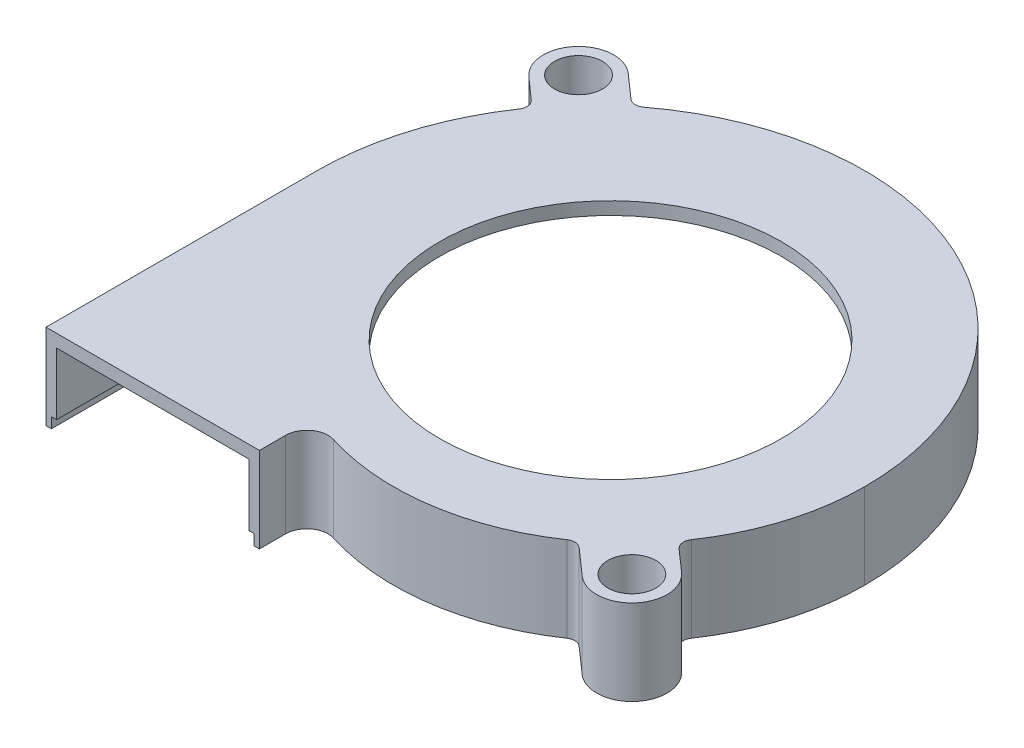
ISO-10303-21;
HEADER;
FILE_DESCRIPTION(('STEP AP214'),'2;1');
FILE_NAME('part.step','',(''),(''),'','','');
FILE_SCHEMA(('AUTOMOTIVE_DESIGN { 1 0 10303 214 1 1 1 1 }'));
ENDSEC;
DATA;
#1=APPLICATION_CONTEXT('core data for automotive mechanical design processes');
#2=APPLICATION_PROTOCOL_DEFINITION('international standard','automotive_design',2000,#1);
#3=PRODUCT_CONTEXT('',#1,'mechanical');
#4=PRODUCT('Part','Part','',(#3));
#5=PRODUCT_RELATED_PRODUCT_CATEGORY('part','',(#4));
#6=PRODUCT_DEFINITION_FORMATION('','',#4);
#7=PRODUCT_DEFINITION_CONTEXT('part definition',#1,'design');
#8=PRODUCT_DEFINITION('design','',#6,#7);
#9=PRODUCT_DEFINITION_SHAPE('','',#8);
#10=(LENGTH_UNIT() NAMED_UNIT(*) SI_UNIT(.MILLI.,.METRE.));
#11=(NAMED_UNIT(*) PLANE_ANGLE_UNIT() SI_UNIT($,.RADIAN.));
#12=(NAMED_UNIT(*) SI_UNIT($,.STERADIAN.) SOLID_ANGLE_UNIT());
#13=UNCERTAINTY_MEASURE_WITH_UNIT(LENGTH_MEASURE(1.E-05),#10,'distance_accuracy_value','');
#14=(GEOMETRIC_REPRESENTATION_CONTEXT(3) GLOBAL_UNCERTAINTY_ASSIGNED_CONTEXT((#13)) GLOBAL_UNIT_ASSIGNED_CONTEXT((#10,
#11,#12)) REPRESENTATION_CONTEXT('',''));
#15=CARTESIAN_POINT('',(0.,0.,0.));
#16=DIRECTION('',(0.,0.,1.));
#17=DIRECTION('',(1.,0.,0.));
#18=AXIS2_PLACEMENT_3D('',#15,#16,#17);
#19=CARTESIAN_POINT('',(-8.5,70.26503959981,25.4));
#20=DIRECTION('',(1.,0.,0.));
#21=DIRECTION('',(0.,0.,-1.));
#22=AXIS2_PLACEMENT_3D('',#19,#20,#21);
#23=PLANE('',#22);
#24=DIRECTION('',(0.,0.,-1.));
#25=VECTOR('',#24,1.);
#26=CARTESIAN_POINT('',(-8.5,-7.,22.9558491109208));
#27=LINE('',#26,#25);
#28=CARTESIAN_POINT('',(-8.5,-7.,25.4));
#29=VERTEX_POINT('',#28);
#30=CARTESIAN_POINT('',(-8.5,-7.,22.9558491109208));
#31=VERTEX_POINT('',#30);
#32=EDGE_CURVE('E630',#29,#31,#27,.T.);
#33=ORIENTED_EDGE('',*,*,#32,.F.);
#34=DIRECTION('',(0.,-1.,0.));
#35=VECTOR('',#34,1.);
#36=CARTESIAN_POINT('',(-8.5,70.26503959981,25.4));
#37=LINE('',#36,#35);
#38=CARTESIAN_POINT('',(-8.5,-1.20000000000001,25.4));
#39=VERTEX_POINT('',#38);
#40=EDGE_CURVE('E578',#39,#29,#37,.T.);
#41=ORIENTED_EDGE('',*,*,#40,.F.);
#42=DIRECTION('',(0.,0.,-1.));
#43=VECTOR('',#42,1.);
#44=CARTESIAN_POINT('',(-8.5,-1.20000000000001,25.4));
#45=LINE('',#44,#43);
#46=CARTESIAN_POINT('',(-8.49999999999999,-1.20000000000001,22.9558491109208));
#47=VERTEX_POINT('',#46);
#48=EDGE_CURVE('E635',#39,#47,#45,.T.);
#49=ORIENTED_EDGE('',*,*,#48,.T.);
#50=DIRECTION('',(0.,-1.,0.));
#51=VECTOR('',#50,1.);
#52=CARTESIAN_POINT('',(-8.5,70.26503959981,22.9558491109208));
#53=LINE('',#52,#51);
#54=EDGE_CURVE('E647',#47,#31,#53,.T.);
#55=ORIENTED_EDGE('',*,*,#54,.T.);
#56=EDGE_LOOP('',(#33,#41,#49,#55));
#57=FACE_BOUND('',#56,.T.);
#58=ADVANCED_FACE('F42',(#57),#23,.F.);
#59=CARTESIAN_POINT('',(-5.5,70.26503959981,22.9558491109208));
#60=DIRECTION('',(0.,-1.,0.));
#61=DIRECTION('',(0.,0.,-1.));
#62=AXIS2_PLACEMENT_3D('',#59,#60,#61);
#63=CYLINDRICAL_SURFACE('',#62,3.);
#64=CARTESIAN_POINT('',(-5.5,-7.,22.9558491109208));
#65=DIRECTION('',(0.,-1.,0.));
#66=DIRECTION('',(0.,0.,-1.));
#67=AXIS2_PLACEMENT_3D('',#64,#65,#66);
#68=CIRCLE('',#67,3.);
#69=CARTESIAN_POINT('',(-4.5985649942554,-7.,20.0944831905794));
#70=VERTEX_POINT('',#69);
#71=EDGE_CURVE('E564',#31,#70,#68,.T.);
#72=ORIENTED_EDGE('',*,*,#71,.F.);
#73=ORIENTED_EDGE('',*,*,#54,.F.);
#74=CARTESIAN_POINT('',(-5.5,-1.20000000000001,22.9558491109208));
#75=DIRECTION('',(0.,-1.,0.));
#76=DIRECTION('',(0.,0.,-1.));
#77=AXIS2_PLACEMENT_3D('',#74,#75,#76);
#78=CIRCLE('',#77,3.);
#79=CARTESIAN_POINT('',(-4.59856499423902,-1.20000000000001,20.0944831905274));
#80=VERTEX_POINT('',#79);
#81=EDGE_CURVE('E585',#47,#80,#78,.T.);
#82=ORIENTED_EDGE('',*,*,#81,.T.);
#83=DIRECTION('',(0.,-1.,0.));
#84=VECTOR('',#83,1.);
#85=CARTESIAN_POINT('',(-4.59856499423902,70.26503959981,20.0944831905274));
#86=LINE('',#85,#84);
#87=EDGE_CURVE('E651',#80,#70,#86,.T.);
#88=ORIENTED_EDGE('',*,*,#87,.T.);
#89=EDGE_LOOP('',(#72,#73,#82,#88));
#90=FACE_BOUND('',#89,.T.);
#91=ADVANCED_FACE('F391',(#90),#63,.T.);
#92=CARTESIAN_POINT('',(1.73193277310925,70.26503959981,0.));
#93=DIRECTION('',(0.,-1.,0.));
#94=DIRECTION('',(0.,0.,-1.));
#95=AXIS2_PLACEMENT_3D('',#92,#93,#94);
#96=CYLINDRICAL_SURFACE('',#95,21.0680672268908);
#97=CARTESIAN_POINT('',(1.73193277310925,-7.,0.));
#98=DIRECTION('',(0.,1.,0.));
#99=DIRECTION('',(0.,0.,-1.));
#100=AXIS2_PLACEMENT_3D('',#97,#98,#99);
#101=CIRCLE('',#100,21.0680672269453);
#102=CARTESIAN_POINT('',(22.800000024916,-7.,-0.000327043078988983));
#103=VERTEX_POINT('',#102);
#104=EDGE_CURVE('E566',#70,#103,#101,.T.);
#105=ORIENTED_EDGE('',*,*,#104,.F.);
#106=ORIENTED_EDGE('',*,*,#87,.F.);
#107=CARTESIAN_POINT('',(1.73193277310925,-1.20000000000001,0.));
#108=DIRECTION('',(0.,-1.,0.));
#109=DIRECTION('',(0.,0.,-1.));
#110=AXIS2_PLACEMENT_3D('',#107,#108,#109);
#111=CIRCLE('',#110,21.0680672268908);
#112=CARTESIAN_POINT('',(22.7999999974641,-1.20000000000001,-0.000326883642031274));
#113=VERTEX_POINT('',#112);
#114=EDGE_CURVE('E577',#80,#113,#111,.F.);
#115=ORIENTED_EDGE('',*,*,#114,.T.);
#116=DIRECTION('',(0.,-1.,0.));
#117=VECTOR('',#116,1.);
#118=CARTESIAN_POINT('',(22.7999999974641,70.26503959981,-0.000326883642031271));
#119=LINE('',#118,#117);
#120=EDGE_CURVE('E655',#113,#103,#119,.T.);
#121=ORIENTED_EDGE('',*,*,#120,.T.);
#122=EDGE_LOOP('',(#105,#106,#115,#121));
#123=FACE_BOUND('',#122,.T.);
#124=ADVANCED_FACE('F397',(#123),#96,.F.);
#125=CARTESIAN_POINT('',(-1.85,70.26503959981,-0.016796874999999));
#126=DIRECTION('',(0.,-1.,0.));
#127=DIRECTION('',(0.,0.,-1.));
#128=AXIS2_PLACEMENT_3D('',#125,#126,#127);
#129=CYLINDRICAL_SURFACE('',#128,24.6500054997072);
#130=CARTESIAN_POINT('',(-1.85,-7.,-0.016796874999999));
#131=DIRECTION('',(0.,1.,0.));
#132=DIRECTION('',(0.,0.,-1.));
#133=AXIS2_PLACEMENT_3D('',#130,#131,#132);
#134=CIRCLE('',#133,24.6500055270525);
#135=CARTESIAN_POINT('',(-26.5000000525161,-7.00000000000001,-0.000327424430267257));
#136=VERTEX_POINT('',#135);
#137=EDGE_CURVE('E63',#103,#136,#134,.T.);
#138=ORIENTED_EDGE('',*,*,#137,.F.);
#139=ORIENTED_EDGE('',*,*,#120,.F.);
#140=CARTESIAN_POINT('',(-1.85,-1.20000000000001,-0.016796874999999));
#141=DIRECTION('',(0.,-1.,0.));
#142=DIRECTION('',(0.,0.,-1.));
#143=AXIS2_PLACEMENT_3D('',#140,#141,#142);
#144=CIRCLE('',#143,24.6500054997072);
#145=CARTESIAN_POINT('',(-26.5000000525161,-1.20000000000001,-0.000327424430267257));
#146=VERTEX_POINT('',#145);
#147=EDGE_CURVE('E575',#113,#146,#144,.F.);
#148=ORIENTED_EDGE('',*,*,#147,.T.);
#149=DIRECTION('',(0.,-1.,0.));
#150=VECTOR('',#149,1.);
#151=CARTESIAN_POINT('',(-26.5000000525161,70.26503959981,-0.000327424430267257));
#152=LINE('',#151,#150);
#153=EDGE_CURVE('E659',#146,#136,#152,.T.);
#154=ORIENTED_EDGE('',*,*,#153,.T.);
#155=EDGE_LOOP('',(#138,#139,#148,#154));
#156=FACE_BOUND('',#155,.T.);
#157=ADVANCED_FACE('F407',(#156),#129,.F.);
#158=CARTESIAN_POINT('',(-26.5000001072067,70.26503959981,-0.000327424393735107));
#159=DIRECTION('',(-1.,0.,4.22068338812948E-09));
#160=DIRECTION('',(4.22068338812948E-09,0.,1.));
#161=AXIS2_PLACEMENT_3D('',#158,#159,#160);
#162=PLANE('',#161);
#163=DIRECTION('',(-4.28055939719574E-11,0.,1.));
#164=VECTOR('',#163,1.);
#165=CARTESIAN_POINT('',(-26.5000000536034,-7.,25.4));
#166=LINE('',#165,#164);
#167=CARTESIAN_POINT('',(-26.5000000536034,-7.,25.4));
#168=VERTEX_POINT('',#167);
#169=EDGE_CURVE('E581',#136,#168,#166,.T.);
#170=ORIENTED_EDGE('',*,*,#169,.F.);
#171=ORIENTED_EDGE('',*,*,#153,.F.);
#172=DIRECTION('',(4.22068338812948E-09,0.,1.));
#173=VECTOR('',#172,1.);
#174=CARTESIAN_POINT('',(-26.5000001072067,-1.20000000000001,-0.000327424393735107));
#175=LINE('',#174,#173);
#176=CARTESIAN_POINT('',(-26.5,-1.20000000000001,25.4));
#177=VERTEX_POINT('',#176);
#178=EDGE_CURVE('E643',#146,#177,#175,.T.);
#179=ORIENTED_EDGE('',*,*,#178,.T.);
#180=DIRECTION('',(0.,-1.,0.));
#181=VECTOR('',#180,1.);
#182=CARTESIAN_POINT('',(-26.5,70.26503959981,25.4));
#183=LINE('',#182,#181);
#184=EDGE_CURVE('E617',#177,#168,#183,.T.);
#185=ORIENTED_EDGE('',*,*,#184,.T.);
#186=EDGE_LOOP('',(#170,#171,#179,#185));
#187=FACE_BOUND('',#186,.T.);
#188=ADVANCED_FACE('F411',(#187),#162,.F.);
#189=CARTESIAN_POINT('',(0.,-8.,0.));
#190=DIRECTION('',(0.,1.,0.));
#191=DIRECTION('',(0.,0.,1.));
#192=AXIS2_PLACEMENT_3D('',#189,#190,#191);
#193=CYLINDRICAL_SURFACE('',#192,16.);
#194=CARTESIAN_POINT('',(0.,0.,0.));
#195=DIRECTION('',(0.,1.,0.));
#196=DIRECTION('',(0.,0.,1.));
#197=AXIS2_PLACEMENT_3D('',#194,#195,#196);
#198=CIRCLE('',#197,16.);
#199=CARTESIAN_POINT('',(0.,0.,16.));
#200=VERTEX_POINT('',#199);
#201=EDGE_CURVE('E435',#200,#200,#198,.T.);
#202=ORIENTED_EDGE('',*,*,#201,.T.);
#203=EDGE_LOOP('',(#202));
#204=FACE_BOUND('',#203,.T.);
#205=CARTESIAN_POINT('',(0.,-1.2,0.));
#206=DIRECTION('',(0.,-1.,0.));
#207=DIRECTION('',(0.,0.,-1.));
#208=AXIS2_PLACEMENT_3D('',#205,#206,#207);
#209=CIRCLE('',#208,16.);
#210=CARTESIAN_POINT('',(0.,-1.2,-16.));
#211=VERTEX_POINT('',#210);
#212=EDGE_CURVE('E46',#211,#211,#209,.F.);
#213=ORIENTED_EDGE('',*,*,#212,.F.);
#214=EDGE_LOOP('',(#213));
#215=FACE_BOUND('',#214,.T.);
#216=ADVANCED_FACE('F388',(#204,#215),#193,.F.);
#217=CARTESIAN_POINT('',(-23.,-8.,-20.));
#218=DIRECTION('',(0.,1.,0.));
#219=DIRECTION('',(0.,0.,1.));
#220=AXIS2_PLACEMENT_3D('',#217,#218,#219);
#221=CYLINDRICAL_SURFACE('',#220,3.3);
#222=CARTESIAN_POINT('',(-23.,0.,-20.));
#223=DIRECTION('',(0.,1.,0.));
#224=DIRECTION('',(0.,0.,-1.));
#225=AXIS2_PLACEMENT_3D('',#222,#223,#224);
#226=CIRCLE('',#225,3.3);
#227=CARTESIAN_POINT('',(-20.8147472716434,0.,-22.4727859820878));
#228=VERTEX_POINT('',#227);
#229=CARTESIAN_POINT('',(-25.1852527283566,0.,-17.5272140179122));
#230=VERTEX_POINT('',#229);
#231=EDGE_CURVE('E262',#228,#230,#226,.T.);
#232=ORIENTED_EDGE('',*,*,#231,.F.);
#233=DIRECTION('',(0.,1.,0.));
#234=VECTOR('',#233,1.);
#235=CARTESIAN_POINT('',(-20.8147472716434,-8.,-22.4727859820878));
#236=LINE('',#235,#234);
#237=CARTESIAN_POINT('',(-20.8147472716434,-8.,-22.4727859820878));
#238=VERTEX_POINT('',#237);
#239=EDGE_CURVE('E12',#238,#228,#236,.T.);
#240=ORIENTED_EDGE('',*,*,#239,.F.);
#241=CARTESIAN_POINT('',(-23.,-8.,-20.));
#242=DIRECTION('',(0.,1.,0.));
#243=DIRECTION('',(0.,0.,-1.));
#244=AXIS2_PLACEMENT_3D('',#241,#242,#243);
#245=CIRCLE('',#244,3.3);
#246=CARTESIAN_POINT('',(-25.1852527283566,-8.,-17.5272140179122));
#247=VERTEX_POINT('',#246);
#248=EDGE_CURVE('E331',#238,#247,#245,.T.);
#249=ORIENTED_EDGE('',*,*,#248,.T.);
#250=DIRECTION('',(0.,1.,0.));
#251=VECTOR('',#250,1.);
#252=CARTESIAN_POINT('',(-25.1852527283566,-8.,-17.5272140179122));
#253=LINE('',#252,#251);
#254=EDGE_CURVE('E160',#247,#230,#253,.T.);
#255=ORIENTED_EDGE('',*,*,#254,.T.);
#256=EDGE_LOOP('',(#232,#240,#249,#255));
#257=FACE_BOUND('',#256,.T.);
#258=ADVANCED_FACE('F44',(#257),#221,.T.);
#259=CARTESIAN_POINT('',(-20.8147472716434,-8.,-22.4727859820878));
#260=DIRECTION('',(0.66219779647171,0.,-0.749329085481147));
#261=DIRECTION('',(-0.749329085481147,0.,-0.66219779647171));
#262=AXIS2_PLACEMENT_3D('',#259,#260,#261);
#263=PLANE('',#262);
#264=DIRECTION('',(-0.749329085481147,0.,-0.66219779647171));
#265=VECTOR('',#264,1.);
#266=CARTESIAN_POINT('',(-20.8147472716434,0.,-22.4727859820878));
#267=LINE('',#266,#265);
#268=CARTESIAN_POINT('',(-18.5989053771657,0.,-20.5146001218517));
#269=VERTEX_POINT('',#268);
#270=EDGE_CURVE('E328',#269,#228,#267,.T.);
#271=ORIENTED_EDGE('',*,*,#270,.F.);
#272=DIRECTION('',(0.,1.,0.));
#273=VECTOR('',#272,1.);
#274=CARTESIAN_POINT('',(-18.5989053771657,-8.,-20.5146001218517));
#275=LINE('',#274,#273);
#276=CARTESIAN_POINT('',(-18.5989053771657,-8.,-20.5146001218517));
#277=VERTEX_POINT('',#276);
#278=EDGE_CURVE('E52',#277,#269,#275,.T.);
#279=ORIENTED_EDGE('',*,*,#278,.F.);
#280=DIRECTION('',(-0.749329085481147,0.,-0.66219779647171));
#281=VECTOR('',#280,1.);
#282=CARTESIAN_POINT('',(-20.8147472716434,-8.,-22.4727859820878));
#283=LINE('',#282,#281);
#284=EDGE_CURVE('E246',#277,#238,#283,.T.);
#285=ORIENTED_EDGE('',*,*,#284,.T.);
#286=ORIENTED_EDGE('',*,*,#239,.T.);
#287=EDGE_LOOP('',(#271,#279,#285,#286));
#288=FACE_BOUND('',#287,.T.);
#289=ADVANCED_FACE('F380',(#288),#263,.T.);
#290=CARTESIAN_POINT('',(-17.936707580694,-8.,-21.2639292073329));
#291=DIRECTION('',(0.,1.,0.));
#292=DIRECTION('',(0.,0.,1.));
#293=AXIS2_PLACEMENT_3D('',#290,#291,#292);
#294=CYLINDRICAL_SURFACE('',#293,1.);
#295=CARTESIAN_POINT('',(-17.936707580694,0.,-21.2639292073329));
#296=DIRECTION('',(0.,-1.,0.));
#297=DIRECTION('',(0.,0.,1.));
#298=AXIS2_PLACEMENT_3D('',#295,#296,#297);
#299=CIRCLE('',#298,1.);
#300=CARTESIAN_POINT('',(-17.3330789029862,0.,-20.4666636183045));
#301=VERTEX_POINT('',#300);
#302=EDGE_CURVE('E230',#301,#269,#299,.T.);
#303=ORIENTED_EDGE('',*,*,#302,.F.);
#304=DIRECTION('',(0.,1.,0.));
#305=VECTOR('',#304,1.);
#306=CARTESIAN_POINT('',(-17.3330789029862,-8.,-20.4666636183045));
#307=LINE('',#306,#305);
#308=CARTESIAN_POINT('',(-17.3330789029862,-8.,-20.4666636183045));
#309=VERTEX_POINT('',#308);
#310=EDGE_CURVE('E224',#309,#301,#307,.T.);
#311=ORIENTED_EDGE('',*,*,#310,.F.);
#312=CARTESIAN_POINT('',(-17.936707580694,-8.,-21.2639292073329));
#313=DIRECTION('',(0.,-1.,0.));
#314=DIRECTION('',(0.,0.,1.));
#315=AXIS2_PLACEMENT_3D('',#312,#313,#314);
#316=CIRCLE('',#315,1.);
#317=EDGE_CURVE('E227',#309,#277,#316,.T.);
#318=ORIENTED_EDGE('',*,*,#317,.T.);
#319=ORIENTED_EDGE('',*,*,#278,.T.);
#320=EDGE_LOOP('',(#303,#311,#318,#319));
#321=FACE_BOUND('',#320,.T.);
#322=ADVANCED_FACE('F226',(#321),#294,.F.);
#323=CARTESIAN_POINT('',(-1.85,-8.,-0.016796874999999));
#324=DIRECTION('',(0.,1.,0.));
#325=DIRECTION('',(0.,0.,1.));
#326=AXIS2_PLACEMENT_3D('',#323,#324,#325);
#327=CYLINDRICAL_SURFACE('',#326,25.6500054997072);
#328=CARTESIAN_POINT('',(-1.85,0.,-0.016796874999999));
#329=DIRECTION('',(0.,1.,0.));
#330=DIRECTION('',(0.,0.,1.));
#331=AXIS2_PLACEMENT_3D('',#328,#329,#330);
#332=CIRCLE('',#331,25.6500054997072);
#333=CARTESIAN_POINT('',(23.8,0.,0.));
#334=VERTEX_POINT('',#333);
#335=EDGE_CURVE('E323',#334,#301,#332,.T.);
#336=ORIENTED_EDGE('',*,*,#335,.F.);
#337=DIRECTION('',(0.,1.,0.));
#338=VECTOR('',#337,1.);
#339=CARTESIAN_POINT('',(23.8,-8.,0.));
#340=LINE('',#339,#338);
#341=CARTESIAN_POINT('',(23.8,-8.,0.));
#342=VERTEX_POINT('',#341);
#343=EDGE_CURVE('E236',#342,#334,#340,.T.);
#344=ORIENTED_EDGE('',*,*,#343,.F.);
#345=CARTESIAN_POINT('',(-1.85,-8.,-0.016796874999999));
#346=DIRECTION('',(0.,1.,0.));
#347=DIRECTION('',(0.,0.,1.));
#348=AXIS2_PLACEMENT_3D('',#345,#346,#347);
#349=CIRCLE('',#348,25.6500054997072);
#350=EDGE_CURVE('E244',#342,#309,#349,.T.);
#351=ORIENTED_EDGE('',*,*,#350,.T.);
#352=ORIENTED_EDGE('',*,*,#310,.T.);
#353=EDGE_LOOP('',(#336,#344,#351,#352));
#354=FACE_BOUND('',#353,.T.);
#355=ADVANCED_FACE('F249',(#354),#327,.T.);
#356=CARTESIAN_POINT('',(1.73193277310925,-8.,0.));
#357=DIRECTION('',(0.,1.,0.));
#358=DIRECTION('',(0.,0.,1.));
#359=AXIS2_PLACEMENT_3D('',#356,#357,#358);
#360=CYLINDRICAL_SURFACE('',#359,22.0680672268908);
#361=CARTESIAN_POINT('',(1.73193277310925,0.,0.));
#362=DIRECTION('',(0.,1.,0.));
#363=DIRECTION('',(0.,0.,-1.));
#364=AXIS2_PLACEMENT_3D('',#361,#362,#363);
#365=CIRCLE('',#364,22.0680672268908);
#366=CARTESIAN_POINT('',(19.9790752063348,0.,12.4113409489929));
#367=VERTEX_POINT('',#366);
#368=EDGE_CURVE('E319',#367,#334,#365,.T.);
#369=ORIENTED_EDGE('',*,*,#368,.F.);
#370=DIRECTION('',(0.,1.,0.));
#371=VECTOR('',#370,1.);
#372=CARTESIAN_POINT('',(19.9790752063348,-8.,12.4113409489929));
#373=LINE('',#372,#371);
#374=CARTESIAN_POINT('',(19.9790752063348,-8.,12.4113409489929));
#375=VERTEX_POINT('',#374);
#376=EDGE_CURVE('E337',#375,#367,#373,.T.);
#377=ORIENTED_EDGE('',*,*,#376,.F.);
#378=CARTESIAN_POINT('',(1.73193277310925,-8.,0.));
#379=DIRECTION('',(0.,1.,0.));
#380=DIRECTION('',(0.,0.,-1.));
#381=AXIS2_PLACEMENT_3D('',#378,#379,#380);
#382=CIRCLE('',#381,22.0680672268908);
#383=EDGE_CURVE('E251',#375,#342,#382,.T.);
#384=ORIENTED_EDGE('',*,*,#383,.T.);
#385=ORIENTED_EDGE('',*,*,#343,.T.);
#386=EDGE_LOOP('',(#369,#377,#384,#385));
#387=FACE_BOUND('',#386,.T.);
#388=ADVANCED_FACE('F978',(#387),#360,.T.);
#389=CARTESIAN_POINT('',(20.8059325040591,-8.,12.9737527280304));
#390=DIRECTION('',(0.,1.,0.));
#391=DIRECTION('',(0.,0.,1.));
#392=AXIS2_PLACEMENT_3D('',#389,#390,#391);
#393=CYLINDRICAL_SURFACE('',#392,1.);
#394=CARTESIAN_POINT('',(20.8059325040591,0.,12.9737527280304));
#395=DIRECTION('',(0.,-1.,0.));
#396=DIRECTION('',(0.,0.,-1.));
#397=AXIS2_PLACEMENT_3D('',#394,#395,#396);
#398=CIRCLE('',#397,1.);
#399=CARTESIAN_POINT('',(20.1437347075874,0.,13.7230818135115));
#400=VERTEX_POINT('',#399);
#401=EDGE_CURVE('E315',#400,#367,#398,.T.);
#402=ORIENTED_EDGE('',*,*,#401,.F.);
#403=DIRECTION('',(0.,1.,0.));
#404=VECTOR('',#403,1.);
#405=CARTESIAN_POINT('',(20.1437347075874,-8.,13.7230818135115));
#406=LINE('',#405,#404);
#407=CARTESIAN_POINT('',(20.1437347075874,-8.,13.7230818135115));
#408=VERTEX_POINT('',#407);
#409=EDGE_CURVE('E340',#408,#400,#406,.T.);
#410=ORIENTED_EDGE('',*,*,#409,.F.);
#411=CARTESIAN_POINT('',(20.8059325040591,-8.,12.9737527280304));
#412=DIRECTION('',(0.,-1.,0.));
#413=DIRECTION('',(0.,0.,-1.));
#414=AXIS2_PLACEMENT_3D('',#411,#412,#413);
#415=CIRCLE('',#414,1.);
#416=EDGE_CURVE('E256',#408,#375,#415,.T.);
#417=ORIENTED_EDGE('',*,*,#416,.T.);
#418=ORIENTED_EDGE('',*,*,#376,.T.);
#419=EDGE_LOOP('',(#402,#410,#417,#418));
#420=FACE_BOUND('',#419,.T.);
#421=ADVANCED_FACE('F508',(#420),#393,.F.);
#422=CARTESIAN_POINT('',(22.1852527283566,-8.,15.5272140179122));
#423=DIRECTION('',(0.66219779647171,0.,-0.749329085481147));
#424=DIRECTION('',(-0.749329085481147,0.,-0.66219779647171));
#425=AXIS2_PLACEMENT_3D('',#422,#423,#424);
#426=PLANE('',#425);
#427=DIRECTION('',(-0.749329085481146,0.,-0.66219779647171));
#428=VECTOR('',#427,1.);
#429=CARTESIAN_POINT('',(22.1852527283566,0.,15.5272140179122));
#430=LINE('',#429,#428);
#431=CARTESIAN_POINT('',(22.1852527283566,0.,15.5272140179122));
#432=VERTEX_POINT('',#431);
#433=EDGE_CURVE('E311',#432,#400,#430,.T.);
#434=ORIENTED_EDGE('',*,*,#433,.F.);
#435=DIRECTION('',(0.,1.,0.));
#436=VECTOR('',#435,1.);
#437=CARTESIAN_POINT('',(22.1852527283566,-8.,15.5272140179122));
#438=LINE('',#437,#436);
#439=CARTESIAN_POINT('',(22.1852527283566,-8.,15.5272140179122));
#440=VERTEX_POINT('',#439);
#441=EDGE_CURVE('E343',#440,#432,#438,.T.);
#442=ORIENTED_EDGE('',*,*,#441,.F.);
#443=DIRECTION('',(-0.749329085481146,0.,-0.66219779647171));
#444=VECTOR('',#443,1.);
#445=CARTESIAN_POINT('',(22.1852527283566,-8.,15.5272140179122));
#446=LINE('',#445,#444);
#447=EDGE_CURVE('E500',#440,#408,#446,.T.);
#448=ORIENTED_EDGE('',*,*,#447,.T.);
#449=ORIENTED_EDGE('',*,*,#409,.T.);
#450=EDGE_LOOP('',(#434,#442,#448,#449));
#451=FACE_BOUND('',#450,.T.);
#452=ADVANCED_FACE('F514',(#451),#426,.T.);
#453=CARTESIAN_POINT('',(20.,-8.,18.));
#454=DIRECTION('',(0.,1.,0.));
#455=DIRECTION('',(0.,0.,1.));
#456=AXIS2_PLACEMENT_3D('',#453,#454,#455);
#457=CYLINDRICAL_SURFACE('',#456,3.3);
#458=CARTESIAN_POINT('',(20.,0.,18.));
#459=DIRECTION('',(0.,1.,0.));
#460=DIRECTION('',(0.,0.,-1.));
#461=AXIS2_PLACEMENT_3D('',#458,#459,#460);
#462=CIRCLE('',#461,3.3);
#463=CARTESIAN_POINT('',(17.8147472716434,0.,20.4727859820878));
#464=VERTEX_POINT('',#463);
#465=EDGE_CURVE('E307',#464,#432,#462,.T.);
#466=ORIENTED_EDGE('',*,*,#465,.F.);
#467=DIRECTION('',(0.,1.,0.));
#468=VECTOR('',#467,1.);
#469=CARTESIAN_POINT('',(17.8147472716434,-8.,20.4727859820878));
#470=LINE('',#469,#468);
#471=CARTESIAN_POINT('',(17.8147472716434,-8.,20.4727859820878));
#472=VERTEX_POINT('',#471);
#473=EDGE_CURVE('E346',#472,#464,#470,.T.);
#474=ORIENTED_EDGE('',*,*,#473,.F.);
#475=CARTESIAN_POINT('',(20.,-8.,18.));
#476=DIRECTION('',(0.,1.,0.));
#477=DIRECTION('',(0.,0.,-1.));
#478=AXIS2_PLACEMENT_3D('',#475,#476,#477);
#479=CIRCLE('',#478,3.3);
#480=EDGE_CURVE('E496',#472,#440,#479,.T.);
#481=ORIENTED_EDGE('',*,*,#480,.T.);
#482=ORIENTED_EDGE('',*,*,#441,.T.);
#483=EDGE_LOOP('',(#466,#474,#481,#482));
#484=FACE_BOUND('',#483,.T.);
#485=ADVANCED_FACE('F517',(#484),#457,.T.);
#486=CARTESIAN_POINT('',(17.8147472716434,-8.,20.4727859820878));
#487=DIRECTION('',(-0.66219779647171,0.,0.749329085481147));
#488=DIRECTION('',(0.749329085481147,0.,0.66219779647171));
#489=AXIS2_PLACEMENT_3D('',#486,#487,#488);
#490=PLANE('',#489);
#491=DIRECTION('',(0.749329085481147,0.,0.66219779647171));
#492=VECTOR('',#491,1.);
#493=CARTESIAN_POINT('',(17.8147472716434,0.,20.4727859820878));
#494=LINE('',#493,#492);
#495=CARTESIAN_POINT('',(15.3769800356374,0.,18.3184800525942));
#496=VERTEX_POINT('',#495);
#497=EDGE_CURVE('E303',#496,#464,#494,.T.);
#498=ORIENTED_EDGE('',*,*,#497,.F.);
#499=DIRECTION('',(0.,1.,0.));
#500=VECTOR('',#499,1.);
#501=CARTESIAN_POINT('',(15.3769800356374,-8.,18.3184800525942));
#502=LINE('',#501,#500);
#503=CARTESIAN_POINT('',(15.3769800356374,-8.,18.3184800525942));
#504=VERTEX_POINT('',#503);
#505=EDGE_CURVE('E349',#504,#496,#502,.T.);
#506=ORIENTED_EDGE('',*,*,#505,.F.);
#507=DIRECTION('',(0.749329085481147,0.,0.66219779647171));
#508=VECTOR('',#507,1.);
#509=CARTESIAN_POINT('',(17.8147472716434,-8.,20.4727859820878));
#510=LINE('',#509,#508);
#511=EDGE_CURVE('E492',#504,#472,#510,.T.);
#512=ORIENTED_EDGE('',*,*,#511,.T.);
#513=ORIENTED_EDGE('',*,*,#473,.T.);
#514=EDGE_LOOP('',(#498,#506,#512,#513));
#515=FACE_BOUND('',#514,.T.);
#516=ADVANCED_FACE('F522',(#515),#490,.T.);
#517=CARTESIAN_POINT('',(14.7147822391657,-8.,19.0678091380753));
#518=DIRECTION('',(0.,1.,0.));
#519=DIRECTION('',(0.,0.,1.));
#520=AXIS2_PLACEMENT_3D('',#517,#518,#519);
#521=CYLINDRICAL_SURFACE('',#520,0.999999999999999);
#522=CARTESIAN_POINT('',(14.7147822391657,0.,19.0678091380753));
#523=DIRECTION('',(0.,-1.,0.));
#524=DIRECTION('',(0.,0.,1.));
#525=AXIS2_PLACEMENT_3D('',#522,#523,#524);
#526=CIRCLE('',#525,0.999999999999999);
#527=CARTESIAN_POINT('',(14.1519761168165,0.,18.2412202023604));
#528=VERTEX_POINT('',#527);
#529=EDGE_CURVE('E299',#528,#496,#526,.T.);
#530=ORIENTED_EDGE('',*,*,#529,.F.);
#531=DIRECTION('',(0.,1.,0.));
#532=VECTOR('',#531,1.);
#533=CARTESIAN_POINT('',(14.1519761168165,-8.,18.2412202023604));
#534=LINE('',#533,#532);
#535=CARTESIAN_POINT('',(14.1519761168165,-8.,18.2412202023604));
#536=VERTEX_POINT('',#535);
#537=EDGE_CURVE('E352',#536,#528,#534,.T.);
#538=ORIENTED_EDGE('',*,*,#537,.F.);
#539=CARTESIAN_POINT('',(14.7147822391657,-8.,19.0678091380753));
#540=DIRECTION('',(0.,-1.,0.));
#541=DIRECTION('',(0.,0.,1.));
#542=AXIS2_PLACEMENT_3D('',#539,#540,#541);
#543=CIRCLE('',#542,0.999999999999999);
#544=EDGE_CURVE('E489',#536,#504,#543,.T.);
#545=ORIENTED_EDGE('',*,*,#544,.T.);
#546=ORIENTED_EDGE('',*,*,#505,.T.);
#547=EDGE_LOOP('',(#530,#538,#545,#546));
#548=FACE_BOUND('',#547,.T.);
#549=ADVANCED_FACE('F525',(#548),#521,.F.);
#550=CARTESIAN_POINT('',(1.73193277310925,-8.,0.));
#551=DIRECTION('',(0.,1.,0.));
#552=DIRECTION('',(0.,0.,1.));
#553=AXIS2_PLACEMENT_3D('',#550,#551,#552);
#554=CYLINDRICAL_SURFACE('',#553,22.0680672268908);
#555=CARTESIAN_POINT('',(1.73193277310925,0.,0.));
#556=DIRECTION('',(0.,1.,0.));
#557=DIRECTION('',(0.,0.,-1.));
#558=AXIS2_PLACEMENT_3D('',#555,#556,#557);
#559=CIRCLE('',#558,22.0680672268908);
#560=CARTESIAN_POINT('',(-4.89904332949268,0.,21.0482718306585));
#561=VERTEX_POINT('',#560);
#562=EDGE_CURVE('E295',#561,#528,#559,.T.);
#563=ORIENTED_EDGE('',*,*,#562,.F.);
#564=DIRECTION('',(0.,1.,0.));
#565=VECTOR('',#564,1.);
#566=CARTESIAN_POINT('',(-4.89904332949268,-8.,21.0482718306585));
#567=LINE('',#566,#565);
#568=CARTESIAN_POINT('',(-4.89904332949268,-8.,21.0482718306585));
#569=VERTEX_POINT('',#568);
#570=EDGE_CURVE('E355',#569,#561,#567,.T.);
#571=ORIENTED_EDGE('',*,*,#570,.F.);
#572=CARTESIAN_POINT('',(1.73193277310925,-8.,0.));
#573=DIRECTION('',(0.,1.,0.));
#574=DIRECTION('',(0.,0.,-1.));
#575=AXIS2_PLACEMENT_3D('',#572,#573,#574);
#576=CIRCLE('',#575,22.0680672268908);
#577=EDGE_CURVE('E486',#569,#536,#576,.T.);
#578=ORIENTED_EDGE('',*,*,#577,.T.);
#579=ORIENTED_EDGE('',*,*,#537,.T.);
#580=EDGE_LOOP('',(#563,#571,#578,#579));
#581=FACE_BOUND('',#580,.T.);
#582=ADVANCED_FACE('F530',(#581),#554,.T.);
#583=CARTESIAN_POINT('',(-5.5,-8.,22.9558491109208));
#584=DIRECTION('',(0.,1.,0.));
#585=DIRECTION('',(0.,0.,1.));
#586=AXIS2_PLACEMENT_3D('',#583,#584,#585);
#587=CYLINDRICAL_SURFACE('',#586,2.);
#588=CARTESIAN_POINT('',(-5.5,0.,22.9558491109208));
#589=DIRECTION('',(0.,-1.,0.));
#590=DIRECTION('',(0.,0.,1.));
#591=AXIS2_PLACEMENT_3D('',#588,#589,#590);
#592=CIRCLE('',#591,2.);
#593=CARTESIAN_POINT('',(-7.5,0.,22.9558491109208));
#594=VERTEX_POINT('',#593);
#595=EDGE_CURVE('E291',#594,#561,#592,.T.);
#596=ORIENTED_EDGE('',*,*,#595,.F.);
#597=DIRECTION('',(0.,1.,0.));
#598=VECTOR('',#597,1.);
#599=CARTESIAN_POINT('',(-7.5,-8.,22.9558491109208));
#600=LINE('',#599,#598);
#601=CARTESIAN_POINT('',(-7.5,-8.,22.9558491109208));
#602=VERTEX_POINT('',#601);
#603=EDGE_CURVE('E358',#602,#594,#600,.T.);
#604=ORIENTED_EDGE('',*,*,#603,.F.);
#605=CARTESIAN_POINT('',(-5.5,-8.,22.9558491109208));
#606=DIRECTION('',(0.,-1.,0.));
#607=DIRECTION('',(0.,0.,1.));
#608=AXIS2_PLACEMENT_3D('',#605,#606,#607);
#609=CIRCLE('',#608,2.);
#610=EDGE_CURVE('E482',#602,#569,#609,.T.);
#611=ORIENTED_EDGE('',*,*,#610,.T.);
#612=ORIENTED_EDGE('',*,*,#570,.T.);
#613=EDGE_LOOP('',(#596,#604,#611,#612));
#614=FACE_BOUND('',#613,.T.);
#615=ADVANCED_FACE('F533',(#614),#587,.F.);
#616=CARTESIAN_POINT('',(-7.5,-8.,25.4));
#617=DIRECTION('',(1.,0.,0.));
#618=DIRECTION('',(0.,0.,-1.));
#619=AXIS2_PLACEMENT_3D('',#616,#617,#618);
#620=PLANE('',#619);
#621=DIRECTION('',(0.,0.,-1.));
#622=VECTOR('',#621,1.);
#623=CARTESIAN_POINT('',(-7.5,0.,25.4));
#624=LINE('',#623,#622);
#625=CARTESIAN_POINT('',(-7.5,0.,25.4));
#626=VERTEX_POINT('',#625);
#627=EDGE_CURVE('E287',#626,#594,#624,.T.);
#628=ORIENTED_EDGE('',*,*,#627,.F.);
#629=DIRECTION('',(0.,1.,0.));
#630=VECTOR('',#629,1.);
#631=CARTESIAN_POINT('',(-7.5,-8.,25.4));
#632=LINE('',#631,#630);
#633=CARTESIAN_POINT('',(-7.5,-8.,25.4));
#634=VERTEX_POINT('',#633);
#635=EDGE_CURVE('E361',#634,#626,#632,.T.);
#636=ORIENTED_EDGE('',*,*,#635,.F.);
#637=DIRECTION('',(0.,0.,-1.));
#638=VECTOR('',#637,1.);
#639=CARTESIAN_POINT('',(-7.5,-8.,25.4));
#640=LINE('',#639,#638);
#641=EDGE_CURVE('E478',#634,#602,#640,.T.);
#642=ORIENTED_EDGE('',*,*,#641,.T.);
#643=ORIENTED_EDGE('',*,*,#603,.T.);
#644=EDGE_LOOP('',(#628,#636,#642,#643));
#645=FACE_BOUND('',#644,.T.);
#646=ADVANCED_FACE('F539',(#645),#620,.T.);
#647=CARTESIAN_POINT('',(-27.5,-8.,25.4));
#648=DIRECTION('',(0.,0.,1.));
#649=DIRECTION('',(1.,0.,0.));
#650=AXIS2_PLACEMENT_3D('',#647,#648,#649);
#651=PLANE('',#650);
#652=DIRECTION('',(0.,-1.,0.));
#653=VECTOR('',#652,1.);
#654=CARTESIAN_POINT('',(-27.0000000525161,-7.,25.4));
#655=LINE('',#654,#653);
#656=CARTESIAN_POINT('',(-27.0000000525161,-7.,25.4));
#657=VERTEX_POINT('',#656);
#658=CARTESIAN_POINT('',(-27.0000000525161,-8.,25.4));
#659=VERTEX_POINT('',#658);
#660=EDGE_CURVE('E627',#657,#659,#655,.T.);
#661=ORIENTED_EDGE('',*,*,#660,.F.);
#662=DIRECTION('',(-1.,0.,0.));
#663=VECTOR('',#662,1.);
#664=CARTESIAN_POINT('',(-27.0000000525161,-7.,25.4));
#665=LINE('',#664,#663);
#666=EDGE_CURVE('E697',#168,#657,#665,.T.);
#667=ORIENTED_EDGE('',*,*,#666,.F.);
#668=ORIENTED_EDGE('',*,*,#184,.F.);
#669=DIRECTION('',(1.,0.,0.));
#670=VECTOR('',#669,1.);
#671=CARTESIAN_POINT('',(-26.5,-1.20000000000001,25.4));
#672=LINE('',#671,#670);
#673=EDGE_CURVE('E639',#177,#39,#672,.T.);
#674=ORIENTED_EDGE('',*,*,#673,.T.);
#675=ORIENTED_EDGE('',*,*,#40,.T.);
#676=DIRECTION('',(-1.,0.,0.));
#677=VECTOR('',#676,1.);
#678=CARTESIAN_POINT('',(-8.5,-7.,25.4));
#679=LINE('',#678,#677);
#680=CARTESIAN_POINT('',(-8.,-7.,25.4));
#681=VERTEX_POINT('',#680);
#682=EDGE_CURVE('E767',#681,#29,#679,.T.);
#683=ORIENTED_EDGE('',*,*,#682,.F.);
#684=DIRECTION('',(0.,-1.,0.));
#685=VECTOR('',#684,1.);
#686=CARTESIAN_POINT('',(-8.,-7.,25.4));
#687=LINE('',#686,#685);
#688=CARTESIAN_POINT('',(-8.,-8.,25.4));
#689=VERTEX_POINT('',#688);
#690=EDGE_CURVE('E548',#681,#689,#687,.T.);
#691=ORIENTED_EDGE('',*,*,#690,.T.);
#692=DIRECTION('',(1.,0.,0.));
#693=VECTOR('',#692,1.);
#694=CARTESIAN_POINT('',(-27.5,-8.,25.4));
#695=LINE('',#694,#693);
#696=EDGE_CURVE('E473',#689,#634,#695,.T.);
#697=ORIENTED_EDGE('',*,*,#696,.T.);
#698=ORIENTED_EDGE('',*,*,#635,.T.);
#699=DIRECTION('',(1.,0.,0.));
#700=VECTOR('',#699,1.);
#701=CARTESIAN_POINT('',(-27.5,0.,25.4));
#702=LINE('',#701,#700);
#703=CARTESIAN_POINT('',(-27.5,0.,25.4));
#704=VERTEX_POINT('',#703);
#705=EDGE_CURVE('E283',#704,#626,#702,.T.);
#706=ORIENTED_EDGE('',*,*,#705,.F.);
#707=DIRECTION('',(0.,1.,0.));
#708=VECTOR('',#707,1.);
#709=CARTESIAN_POINT('',(-27.5,-8.,25.4));
#710=LINE('',#709,#708);
#711=CARTESIAN_POINT('',(-27.5,-8.,25.4));
#712=VERTEX_POINT('',#711);
#713=EDGE_CURVE('E364',#712,#704,#710,.T.);
#714=ORIENTED_EDGE('',*,*,#713,.F.);
#715=EDGE_CURVE('E474',#712,#659,#695,.T.);
#716=ORIENTED_EDGE('',*,*,#715,.T.);
#717=EDGE_LOOP('',(#661,#667,#668,#674,#675,#683,#691,#697,#698,#706,#714,#716));
#718=FACE_BOUND('',#717,.T.);
#719=ADVANCED_FACE('F543',(#718),#651,.T.);
#720=CARTESIAN_POINT('',(-27.5,-8.,25.4));
#721=DIRECTION('',(-1.,0.,0.));
#722=DIRECTION('',(0.,0.,1.));
#723=AXIS2_PLACEMENT_3D('',#720,#721,#722);
#724=PLANE('',#723);
#725=DIRECTION('',(0.,0.,1.));
#726=VECTOR('',#725,1.);
#727=CARTESIAN_POINT('',(-27.5,0.,25.4));
#728=LINE('',#727,#726);
#729=CARTESIAN_POINT('',(-27.5,0.,0.));
#730=VERTEX_POINT('',#729);
#731=EDGE_CURVE('E279',#730,#704,#728,.T.);
#732=ORIENTED_EDGE('',*,*,#731,.F.);
#733=DIRECTION('',(0.,1.,0.));
#734=VECTOR('',#733,1.);
#735=CARTESIAN_POINT('',(-27.5,-8.,0.));
#736=LINE('',#735,#734);
#737=CARTESIAN_POINT('',(-27.5,-8.,0.));
#738=VERTEX_POINT('',#737);
#739=EDGE_CURVE('E367',#738,#730,#736,.T.);
#740=ORIENTED_EDGE('',*,*,#739,.F.);
#741=DIRECTION('',(0.,0.,1.));
#742=VECTOR('',#741,1.);
#743=CARTESIAN_POINT('',(-27.5,-8.,25.4));
#744=LINE('',#743,#742);
#745=EDGE_CURVE('E469',#738,#712,#744,.T.);
#746=ORIENTED_EDGE('',*,*,#745,.T.);
#747=ORIENTED_EDGE('',*,*,#713,.T.);
#748=EDGE_LOOP('',(#732,#740,#746,#747));
#749=FACE_BOUND('',#748,.T.);
#750=ADVANCED_FACE('F876',(#749),#724,.T.);
#751=CARTESIAN_POINT('',(-1.85,-8.,-0.016796874999999));
#752=DIRECTION('',(0.,1.,0.));
#753=DIRECTION('',(0.,0.,1.));
#754=AXIS2_PLACEMENT_3D('',#751,#752,#753);
#755=CYLINDRICAL_SURFACE('',#754,25.6500054997072);
#756=CARTESIAN_POINT('',(-1.85,0.,-0.016796874999999));
#757=DIRECTION('',(0.,1.,0.));
#758=DIRECTION('',(0.,0.,1.));
#759=AXIS2_PLACEMENT_3D('',#756,#757,#758);
#760=CIRCLE('',#759,25.6500054997072);
#761=CARTESIAN_POINT('',(-23.0428472901912,0.,-14.4662261325744));
#762=VERTEX_POINT('',#761);
#763=EDGE_CURVE('E275',#762,#730,#760,.T.);
#764=ORIENTED_EDGE('',*,*,#763,.F.);
#765=DIRECTION('',(0.,1.,0.));
#766=VECTOR('',#765,1.);
#767=CARTESIAN_POINT('',(-23.0428472901912,-8.,-14.4662261325744));
#768=LINE('',#767,#766);
#769=CARTESIAN_POINT('',(-23.0428472901912,-8.,-14.4662261325744));
#770=VERTEX_POINT('',#769);
#771=EDGE_CURVE('E370',#770,#762,#768,.T.);
#772=ORIENTED_EDGE('',*,*,#771,.F.);
#773=CARTESIAN_POINT('',(-1.85,-8.,-0.016796874999999));
#774=DIRECTION('',(0.,1.,0.));
#775=DIRECTION('',(0.,0.,1.));
#776=AXIS2_PLACEMENT_3D('',#773,#774,#775);
#777=CIRCLE('',#776,25.6500054997072);
#778=EDGE_CURVE('E465',#770,#738,#777,.T.);
#779=ORIENTED_EDGE('',*,*,#778,.T.);
#780=ORIENTED_EDGE('',*,*,#739,.T.);
#781=EDGE_LOOP('',(#764,#772,#779,#780));
#782=FACE_BOUND('',#781,.T.);
#783=ADVANCED_FACE('F901',(#782),#755,.T.);
#784=CARTESIAN_POINT('',(-23.8690789762013,-8.,-15.0295565871327));
#785=DIRECTION('',(0.,1.,0.));
#786=DIRECTION('',(0.,0.,1.));
#787=AXIS2_PLACEMENT_3D('',#784,#785,#786);
#788=CYLINDRICAL_SURFACE('',#787,1.);
#789=CARTESIAN_POINT('',(-23.8690789762013,0.,-15.0295565871327));
#790=DIRECTION('',(0.,-1.,0.));
#791=DIRECTION('',(0.,0.,-1.));
#792=AXIS2_PLACEMENT_3D('',#789,#790,#791);
#793=CIRCLE('',#792,1.);
#794=CARTESIAN_POINT('',(-23.2068811797296,0.,-15.7788856726139));
#795=VERTEX_POINT('',#794);
#796=EDGE_CURVE('E271',#795,#762,#793,.T.);
#797=ORIENTED_EDGE('',*,*,#796,.F.);
#798=DIRECTION('',(0.,1.,0.));
#799=VECTOR('',#798,1.);
#800=CARTESIAN_POINT('',(-23.2068811797296,-8.,-15.7788856726139));
#801=LINE('',#800,#799);
#802=CARTESIAN_POINT('',(-23.2068811797296,-8.,-15.7788856726139));
#803=VERTEX_POINT('',#802);
#804=EDGE_CURVE('E373',#803,#795,#801,.T.);
#805=ORIENTED_EDGE('',*,*,#804,.F.);
#806=CARTESIAN_POINT('',(-23.8690789762013,-8.,-15.0295565871327));
#807=DIRECTION('',(0.,-1.,0.));
#808=DIRECTION('',(0.,0.,-1.));
#809=AXIS2_PLACEMENT_3D('',#806,#807,#808);
#810=CIRCLE('',#809,1.);
#811=EDGE_CURVE('E461',#803,#770,#810,.T.);
#812=ORIENTED_EDGE('',*,*,#811,.T.);
#813=ORIENTED_EDGE('',*,*,#771,.T.);
#814=EDGE_LOOP('',(#797,#805,#812,#813));
#815=FACE_BOUND('',#814,.T.);
#816=ADVANCED_FACE('F896',(#815),#788,.F.);
#817=CARTESIAN_POINT('',(-25.1852527283566,-8.,-17.5272140179122));
#818=DIRECTION('',(-0.662197796471712,0.,0.749329085481145));
#819=DIRECTION('',(0.749329085481145,0.,0.662197796471712));
#820=AXIS2_PLACEMENT_3D('',#817,#818,#819);
#821=PLANE('',#820);
#822=DIRECTION('',(0.749329085481145,0.,0.662197796471712));
#823=VECTOR('',#822,1.);
#824=CARTESIAN_POINT('',(-25.1852527283566,0.,-17.5272140179122));
#825=LINE('',#824,#823);
#826=EDGE_CURVE('E266',#230,#795,#825,.T.);
#827=ORIENTED_EDGE('',*,*,#826,.F.);
#828=ORIENTED_EDGE('',*,*,#254,.F.);
#829=DIRECTION('',(0.749329085481145,0.,0.662197796471712));
#830=VECTOR('',#829,1.);
#831=CARTESIAN_POINT('',(-25.1852527283566,-8.,-17.5272140179122));
#832=LINE('',#831,#830);
#833=EDGE_CURVE('E458',#247,#803,#832,.T.);
#834=ORIENTED_EDGE('',*,*,#833,.T.);
#835=ORIENTED_EDGE('',*,*,#804,.T.);
#836=EDGE_LOOP('',(#827,#828,#834,#835));
#837=FACE_BOUND('',#836,.T.);
#838=ADVANCED_FACE('F376',(#837),#821,.T.);
#839=CARTESIAN_POINT('',(-23.,-8.,-20.));
#840=DIRECTION('',(0.,-1.,0.));
#841=DIRECTION('',(0.,0.,-1.));
#842=AXIS2_PLACEMENT_3D('',#839,#840,#841);
#843=PLANE('',#842);
#844=DIRECTION('',(0.,0.,1.));
#845=VECTOR('',#844,1.);
#846=CARTESIAN_POINT('',(-7.99999999999999,-8.,22.9558491109208));
#847=LINE('',#846,#845);
#848=CARTESIAN_POINT('',(-7.99999999999999,-8.,22.9558491109208));
#849=VERTEX_POINT('',#848);
#850=EDGE_CURVE('E567',#849,#689,#847,.T.);
#851=ORIENTED_EDGE('',*,*,#850,.F.);
#852=CARTESIAN_POINT('',(-5.5,-8.,22.9558491109208));
#853=DIRECTION('',(0.,1.,0.));
#854=DIRECTION('',(0.,0.,-1.));
#855=AXIS2_PLACEMENT_3D('',#852,#853,#854);
#856=CIRCLE('',#855,2.5);
#857=CARTESIAN_POINT('',(-4.74880416186585,-8.,20.5713775105929));
#858=VERTEX_POINT('',#857);
#859=EDGE_CURVE('E570',#858,#849,#856,.T.);
#860=ORIENTED_EDGE('',*,*,#859,.F.);
#861=CARTESIAN_POINT('',(1.73193277310925,-8.,0.));
#862=DIRECTION('',(0.,-1.,0.));
#863=DIRECTION('',(0.,0.,-1.));
#864=AXIS2_PLACEMENT_3D('',#861,#862,#863);
#865=CIRCLE('',#864,21.5680672268908);
#866=CARTESIAN_POINT('',(23.299999999651,-8.,-0.000122693548603174));
#867=VERTEX_POINT('',#866);
#868=EDGE_CURVE('E572',#867,#858,#865,.T.);
#869=ORIENTED_EDGE('',*,*,#868,.F.);
#870=CARTESIAN_POINT('',(-1.85,-8.,-0.016796874999999));
#871=DIRECTION('',(0.,-1.,0.));
#872=DIRECTION('',(0.,0.,-1.));
#873=AXIS2_PLACEMENT_3D('',#870,#871,#872);
#874=CIRCLE('',#873,25.1500055062662);
#875=CARTESIAN_POINT('',(-27.0000000038298,-8.,-0.000160391496041035));
#876=VERTEX_POINT('',#875);
#877=EDGE_CURVE('E594',#876,#867,#874,.T.);
#878=ORIENTED_EDGE('',*,*,#877,.F.);
#879=DIRECTION('',(2.73512697014853E-09,0.,-1.));
#880=VECTOR('',#879,1.);
#881=CARTESIAN_POINT('',(-27.0000000525161,-8.,25.4));
#882=LINE('',#881,#880);
#883=EDGE_CURVE('E596',#659,#876,#882,.T.);
#884=ORIENTED_EDGE('',*,*,#883,.F.);
#885=ORIENTED_EDGE('',*,*,#715,.F.);
#886=ORIENTED_EDGE('',*,*,#745,.F.);
#887=ORIENTED_EDGE('',*,*,#778,.F.);
#888=ORIENTED_EDGE('',*,*,#811,.F.);
#889=ORIENTED_EDGE('',*,*,#833,.F.);
#890=ORIENTED_EDGE('',*,*,#248,.F.);
#891=ORIENTED_EDGE('',*,*,#284,.F.);
#892=ORIENTED_EDGE('',*,*,#317,.F.);
#893=ORIENTED_EDGE('',*,*,#350,.F.);
#894=ORIENTED_EDGE('',*,*,#383,.F.);
#895=ORIENTED_EDGE('',*,*,#416,.F.);
#896=ORIENTED_EDGE('',*,*,#447,.F.);
#897=ORIENTED_EDGE('',*,*,#480,.F.);
#898=ORIENTED_EDGE('',*,*,#511,.F.);
#899=ORIENTED_EDGE('',*,*,#544,.F.);
#900=ORIENTED_EDGE('',*,*,#577,.F.);
#901=ORIENTED_EDGE('',*,*,#610,.F.);
#902=ORIENTED_EDGE('',*,*,#641,.F.);
#903=ORIENTED_EDGE('',*,*,#696,.F.);
#904=EDGE_LOOP('',(#851,#860,#869,#878,#884,#885,#886,#887,#888,#889,#890,#891,#892,#893,#894,
#895,#896,#897,#898,#899,#900,#901,#902,#903));
#905=FACE_BOUND('',#904,.T.);
#906=CARTESIAN_POINT('',(20.,-8.,18.));
#907=DIRECTION('',(0.,1.,0.));
#908=DIRECTION('',(0.,0.,1.));
#909=AXIS2_PLACEMENT_3D('',#906,#907,#908);
#910=CIRCLE('',#909,2.25);
#911=CARTESIAN_POINT('',(20.,-8.,20.25));
#912=VERTEX_POINT('',#911);
#913=EDGE_CURVE('E445',#912,#912,#910,.T.);
#914=ORIENTED_EDGE('',*,*,#913,.T.);
#915=EDGE_LOOP('',(#914));
#916=FACE_BOUND('',#915,.T.);
#917=CARTESIAN_POINT('',(-23.,-8.,-20.));
#918=DIRECTION('',(0.,1.,0.));
#919=DIRECTION('',(0.,0.,1.));
#920=AXIS2_PLACEMENT_3D('',#917,#918,#919);
#921=CIRCLE('',#920,2.25);
#922=CARTESIAN_POINT('',(-23.,-8.,-17.75));
#923=VERTEX_POINT('',#922);
#924=EDGE_CURVE('E267',#923,#923,#921,.T.);
#925=ORIENTED_EDGE('',*,*,#924,.T.);
#926=EDGE_LOOP('',(#925));
#927=FACE_BOUND('',#926,.T.);
#928=ADVANCED_FACE('F241',(#905,#916,#927),#843,.T.);
#929=CARTESIAN_POINT('',(-23.,0.,-20.));
#930=DIRECTION('',(0.,-1.,0.));
#931=DIRECTION('',(0.,0.,-1.));
#932=AXIS2_PLACEMENT_3D('',#929,#930,#931);
#933=PLANE('',#932);
#934=ORIENTED_EDGE('',*,*,#201,.F.);
#935=EDGE_LOOP('',(#934));
#936=FACE_BOUND('',#935,.T.);
#937=CARTESIAN_POINT('',(20.,0.,18.));
#938=DIRECTION('',(0.,1.,0.));
#939=DIRECTION('',(0.,0.,1.));
#940=AXIS2_PLACEMENT_3D('',#937,#938,#939);
#941=CIRCLE('',#940,2.25);
#942=CARTESIAN_POINT('',(20.,0.,20.25));
#943=VERTEX_POINT('',#942);
#944=EDGE_CURVE('E439',#943,#943,#941,.T.);
#945=ORIENTED_EDGE('',*,*,#944,.F.);
#946=EDGE_LOOP('',(#945));
#947=FACE_BOUND('',#946,.T.);
#948=CARTESIAN_POINT('',(-23.,0.,-20.));
#949=DIRECTION('',(0.,1.,0.));
#950=DIRECTION('',(0.,0.,1.));
#951=AXIS2_PLACEMENT_3D('',#948,#949,#950);
#952=CIRCLE('',#951,2.25);
#953=CARTESIAN_POINT('',(-23.,0.,-17.75));
#954=VERTEX_POINT('',#953);
#955=EDGE_CURVE('E442',#954,#954,#952,.T.);
#956=ORIENTED_EDGE('',*,*,#955,.F.);
#957=EDGE_LOOP('',(#956));
#958=FACE_BOUND('',#957,.T.);
#959=ORIENTED_EDGE('',*,*,#231,.T.);
#960=ORIENTED_EDGE('',*,*,#826,.T.);
#961=ORIENTED_EDGE('',*,*,#796,.T.);
#962=ORIENTED_EDGE('',*,*,#763,.T.);
#963=ORIENTED_EDGE('',*,*,#731,.T.);
#964=ORIENTED_EDGE('',*,*,#705,.T.);
#965=ORIENTED_EDGE('',*,*,#627,.T.);
#966=ORIENTED_EDGE('',*,*,#595,.T.);
#967=ORIENTED_EDGE('',*,*,#562,.T.);
#968=ORIENTED_EDGE('',*,*,#529,.T.);
#969=ORIENTED_EDGE('',*,*,#497,.T.);
#970=ORIENTED_EDGE('',*,*,#465,.T.);
#971=ORIENTED_EDGE('',*,*,#433,.T.);
#972=ORIENTED_EDGE('',*,*,#401,.T.);
#973=ORIENTED_EDGE('',*,*,#368,.T.);
#974=ORIENTED_EDGE('',*,*,#335,.T.);
#975=ORIENTED_EDGE('',*,*,#302,.T.);
#976=ORIENTED_EDGE('',*,*,#270,.T.);
#977=EDGE_LOOP('',(#959,#960,#961,#962,#963,#964,#965,#966,#967,#968,#969,#970,#971,#972,#973,
#974,#975,#976));
#978=FACE_BOUND('',#977,.T.);
#979=ADVANCED_FACE('F379',(#936,#947,#958,#978),#933,.F.);
#980=CARTESIAN_POINT('',(-23.,-8.,-20.));
#981=DIRECTION('',(0.,1.,0.));
#982=DIRECTION('',(0.,0.,1.));
#983=AXIS2_PLACEMENT_3D('',#980,#981,#982);
#984=CYLINDRICAL_SURFACE('',#983,2.25);
#985=ORIENTED_EDGE('',*,*,#924,.F.);
#986=EDGE_LOOP('',(#985));
#987=FACE_BOUND('',#986,.T.);
#988=ORIENTED_EDGE('',*,*,#955,.T.);
#989=EDGE_LOOP('',(#988));
#990=FACE_BOUND('',#989,.T.);
#991=ADVANCED_FACE('F422',(#987,#990),#984,.F.);
#992=CARTESIAN_POINT('',(20.,-8.,18.));
#993=DIRECTION('',(0.,1.,0.));
#994=DIRECTION('',(0.,0.,1.));
#995=AXIS2_PLACEMENT_3D('',#992,#993,#994);
#996=CYLINDRICAL_SURFACE('',#995,2.25);
#997=ORIENTED_EDGE('',*,*,#913,.F.);
#998=EDGE_LOOP('',(#997));
#999=FACE_BOUND('',#998,.T.);
#1000=ORIENTED_EDGE('',*,*,#944,.T.);
#1001=EDGE_LOOP('',(#1000));
#1002=FACE_BOUND('',#1001,.T.);
#1003=ADVANCED_FACE('F419',(#999,#1002),#996,.F.);
#1004=CARTESIAN_POINT('',(-23.,-1.2,-20.));
#1005=DIRECTION('',(0.,-1.,0.));
#1006=DIRECTION('',(0.,0.,-1.));
#1007=AXIS2_PLACEMENT_3D('',#1004,#1005,#1006);
#1008=PLANE('',#1007);
#1009=ORIENTED_EDGE('',*,*,#673,.F.);
#1010=ORIENTED_EDGE('',*,*,#178,.F.);
#1011=ORIENTED_EDGE('',*,*,#147,.F.);
#1012=ORIENTED_EDGE('',*,*,#114,.F.);
#1013=ORIENTED_EDGE('',*,*,#81,.F.);
#1014=ORIENTED_EDGE('',*,*,#48,.F.);
#1015=EDGE_LOOP('',(#1009,#1010,#1011,#1012,#1013,#1014));
#1016=FACE_BOUND('',#1015,.T.);
#1017=ORIENTED_EDGE('',*,*,#212,.T.);
#1018=EDGE_LOOP('',(#1017));
#1019=FACE_BOUND('',#1018,.T.);
#1020=ADVANCED_FACE('F402',(#1016,#1019),#1008,.T.);
#1021=CARTESIAN_POINT('',(-7.99999999999999,-7.,22.9558491109208));
#1022=DIRECTION('',(1.,0.,0.));
#1023=DIRECTION('',(0.,0.,-1.));
#1024=AXIS2_PLACEMENT_3D('',#1021,#1022,#1023);
#1025=PLANE('',#1024);
#1026=ORIENTED_EDGE('',*,*,#850,.T.);
#1027=ORIENTED_EDGE('',*,*,#690,.F.);
#1028=DIRECTION('',(0.,0.,1.));
#1029=VECTOR('',#1028,1.);
#1030=CARTESIAN_POINT('',(-7.99999999999999,-7.,22.9558491109208));
#1031=LINE('',#1030,#1029);
#1032=CARTESIAN_POINT('',(-7.99999999999999,-7.,22.9558491109208));
#1033=VERTEX_POINT('',#1032);
#1034=EDGE_CURVE('E561',#1033,#681,#1031,.T.);
#1035=ORIENTED_EDGE('',*,*,#1034,.F.);
#1036=DIRECTION('',(0.,-1.,0.));
#1037=VECTOR('',#1036,1.);
#1038=CARTESIAN_POINT('',(-7.99999999999999,-7.,22.9558491109208));
#1039=LINE('',#1038,#1037);
#1040=EDGE_CURVE('E555',#1033,#849,#1039,.T.);
#1041=ORIENTED_EDGE('',*,*,#1040,.T.);
#1042=EDGE_LOOP('',(#1026,#1027,#1035,#1041));
#1043=FACE_BOUND('',#1042,.T.);
#1044=ADVANCED_FACE('F675',(#1043),#1025,.F.);
#1045=CARTESIAN_POINT('',(-5.5,-7.,22.9558491109208));
#1046=DIRECTION('',(0.,-1.,0.));
#1047=DIRECTION('',(0.,0.,-1.));
#1048=AXIS2_PLACEMENT_3D('',#1045,#1046,#1047);
#1049=CYLINDRICAL_SURFACE('',#1048,2.5);
#1050=ORIENTED_EDGE('',*,*,#859,.T.);
#1051=ORIENTED_EDGE('',*,*,#1040,.F.);
#1052=CARTESIAN_POINT('',(-5.5,-7.,22.9558491109208));
#1053=DIRECTION('',(0.,1.,0.));
#1054=DIRECTION('',(0.,0.,-1.));
#1055=AXIS2_PLACEMENT_3D('',#1052,#1053,#1054);
#1056=CIRCLE('',#1055,2.5);
#1057=CARTESIAN_POINT('',(-4.74880416186585,-7.,20.5713775105929));
#1058=VERTEX_POINT('',#1057);
#1059=EDGE_CURVE('E558',#1058,#1033,#1056,.T.);
#1060=ORIENTED_EDGE('',*,*,#1059,.F.);
#1061=DIRECTION('',(0.,-1.,0.));
#1062=VECTOR('',#1061,1.);
#1063=CARTESIAN_POINT('',(-4.74880416186585,-7.,20.5713775105929));
#1064=LINE('',#1063,#1062);
#1065=EDGE_CURVE('E552',#1058,#858,#1064,.T.);
#1066=ORIENTED_EDGE('',*,*,#1065,.T.);
#1067=EDGE_LOOP('',(#1050,#1051,#1060,#1066));
#1068=FACE_BOUND('',#1067,.T.);
#1069=ADVANCED_FACE('F680',(#1068),#1049,.T.);
#1070=CARTESIAN_POINT('',(1.73193277310925,-7.,0.));
#1071=DIRECTION('',(0.,-1.,0.));
#1072=DIRECTION('',(0.,0.,-1.));
#1073=AXIS2_PLACEMENT_3D('',#1070,#1071,#1072);
#1074=CYLINDRICAL_SURFACE('',#1073,21.5680672268908);
#1075=ORIENTED_EDGE('',*,*,#868,.T.);
#1076=ORIENTED_EDGE('',*,*,#1065,.F.);
#1077=CARTESIAN_POINT('',(1.73193277310925,-7.,0.));
#1078=DIRECTION('',(0.,-1.,0.));
#1079=DIRECTION('',(0.,0.,-1.));
#1080=AXIS2_PLACEMENT_3D('',#1077,#1078,#1079);
#1081=CIRCLE('',#1080,21.5680672268908);
#1082=CARTESIAN_POINT('',(23.299999999651,-7.,-0.000122693548603174));
#1083=VERTEX_POINT('',#1082);
#1084=EDGE_CURVE('E562',#1083,#1058,#1081,.T.);
#1085=ORIENTED_EDGE('',*,*,#1084,.F.);
#1086=DIRECTION('',(0.,-1.,0.));
#1087=VECTOR('',#1086,1.);
#1088=CARTESIAN_POINT('',(23.299999999651,-7.,-0.000122693548603174));
#1089=LINE('',#1088,#1087);
#1090=EDGE_CURVE('E556',#1083,#867,#1089,.T.);
#1091=ORIENTED_EDGE('',*,*,#1090,.T.);
#1092=EDGE_LOOP('',(#1075,#1076,#1085,#1091));
#1093=FACE_BOUND('',#1092,.T.);
#1094=ADVANCED_FACE('F798',(#1093),#1074,.F.);
#1095=CARTESIAN_POINT('',(-1.85,-7.,-0.016796874999999));
#1096=DIRECTION('',(0.,-1.,0.));
#1097=DIRECTION('',(0.,0.,-1.));
#1098=AXIS2_PLACEMENT_3D('',#1095,#1096,#1097);
#1099=CYLINDRICAL_SURFACE('',#1098,25.1500055062662);
#1100=ORIENTED_EDGE('',*,*,#877,.T.);
#1101=ORIENTED_EDGE('',*,*,#1090,.F.);
#1102=CARTESIAN_POINT('',(-1.85,-7.,-0.016796874999999));
#1103=DIRECTION('',(0.,-1.,0.));
#1104=DIRECTION('',(0.,0.,-1.));
#1105=AXIS2_PLACEMENT_3D('',#1102,#1103,#1104);
#1106=CIRCLE('',#1105,25.1500055062662);
#1107=CARTESIAN_POINT('',(-27.0000000038298,-7.,-0.000160391496041035));
#1108=VERTEX_POINT('',#1107);
#1109=EDGE_CURVE('E589',#1108,#1083,#1106,.T.);
#1110=ORIENTED_EDGE('',*,*,#1109,.F.);
#1111=DIRECTION('',(0.,-1.,0.));
#1112=VECTOR('',#1111,1.);
#1113=CARTESIAN_POINT('',(-27.0000000038298,-7.,-0.000160391496041035));
#1114=LINE('',#1113,#1112);
#1115=EDGE_CURVE('E624',#1108,#876,#1114,.T.);
#1116=ORIENTED_EDGE('',*,*,#1115,.T.);
#1117=EDGE_LOOP('',(#1100,#1101,#1110,#1116));
#1118=FACE_BOUND('',#1117,.T.);
#1119=ADVANCED_FACE('F793',(#1118),#1099,.F.);
#1120=CARTESIAN_POINT('',(-27.0000000525161,-7.,25.4));
#1121=DIRECTION('',(-1.,0.,-2.73512697014853E-09));
#1122=DIRECTION('',(-2.73512697014853E-09,0.,1.));
#1123=AXIS2_PLACEMENT_3D('',#1120,#1121,#1122);
#1124=PLANE('',#1123);
#1125=ORIENTED_EDGE('',*,*,#883,.T.);
#1126=ORIENTED_EDGE('',*,*,#1115,.F.);
#1127=DIRECTION('',(2.73512697014853E-09,0.,-1.));
#1128=VECTOR('',#1127,1.);
#1129=CARTESIAN_POINT('',(-27.0000000525161,-7.,25.4));
#1130=LINE('',#1129,#1128);
#1131=EDGE_CURVE('E592',#657,#1108,#1130,.T.);
#1132=ORIENTED_EDGE('',*,*,#1131,.F.);
#1133=ORIENTED_EDGE('',*,*,#660,.T.);
#1134=EDGE_LOOP('',(#1125,#1126,#1132,#1133));
#1135=FACE_BOUND('',#1134,.T.);
#1136=ADVANCED_FACE('F788',(#1135),#1124,.F.);
#1137=CARTESIAN_POINT('',(-5.5,-7.,22.9558491109208));
#1138=DIRECTION('',(0.,-1.,0.));
#1139=DIRECTION('',(0.,0.,-1.));
#1140=AXIS2_PLACEMENT_3D('',#1137,#1138,#1139);
#1141=PLANE('',#1140);
#1142=ORIENTED_EDGE('',*,*,#71,.T.);
#1143=ORIENTED_EDGE('',*,*,#104,.T.);
#1144=ORIENTED_EDGE('',*,*,#137,.T.);
#1145=ORIENTED_EDGE('',*,*,#169,.T.);
#1146=ORIENTED_EDGE('',*,*,#666,.T.);
#1147=ORIENTED_EDGE('',*,*,#1131,.T.);
#1148=ORIENTED_EDGE('',*,*,#1109,.T.);
#1149=ORIENTED_EDGE('',*,*,#1084,.T.);
#1150=ORIENTED_EDGE('',*,*,#1059,.T.);
#1151=ORIENTED_EDGE('',*,*,#1034,.T.);
#1152=ORIENTED_EDGE('',*,*,#682,.T.);
#1153=ORIENTED_EDGE('',*,*,#32,.T.);
#1154=EDGE_LOOP('',(#1142,#1143,#1144,#1145,#1146,#1147,#1148,#1149,#1150,#1151,#1152,#1153));
#1155=FACE_BOUND('',#1154,.T.);
#1156=ADVANCED_FACE('F785',(#1155),#1141,.T.);
#1157=CLOSED_SHELL('',(#58,#91,#124,#157,#188,#216,#258,#289,#322,#355,#388,#421,#452,#485,#516,
#549,#582,#615,#646,#719,#750,#783,#816,#838,#928,#979,#991,#1003,#1020,#1044,#1069,#1094,#1119,
#1136,#1156));
#1158=MANIFOLD_SOLID_BREP('B2',#1157);
#1159=ADVANCED_BREP_SHAPE_REPRESENTATION('',(#18,#1158),#14);
#1160=SHAPE_DEFINITION_REPRESENTATION(#9,#1159);
ENDSEC;
END-ISO-10303-21;
